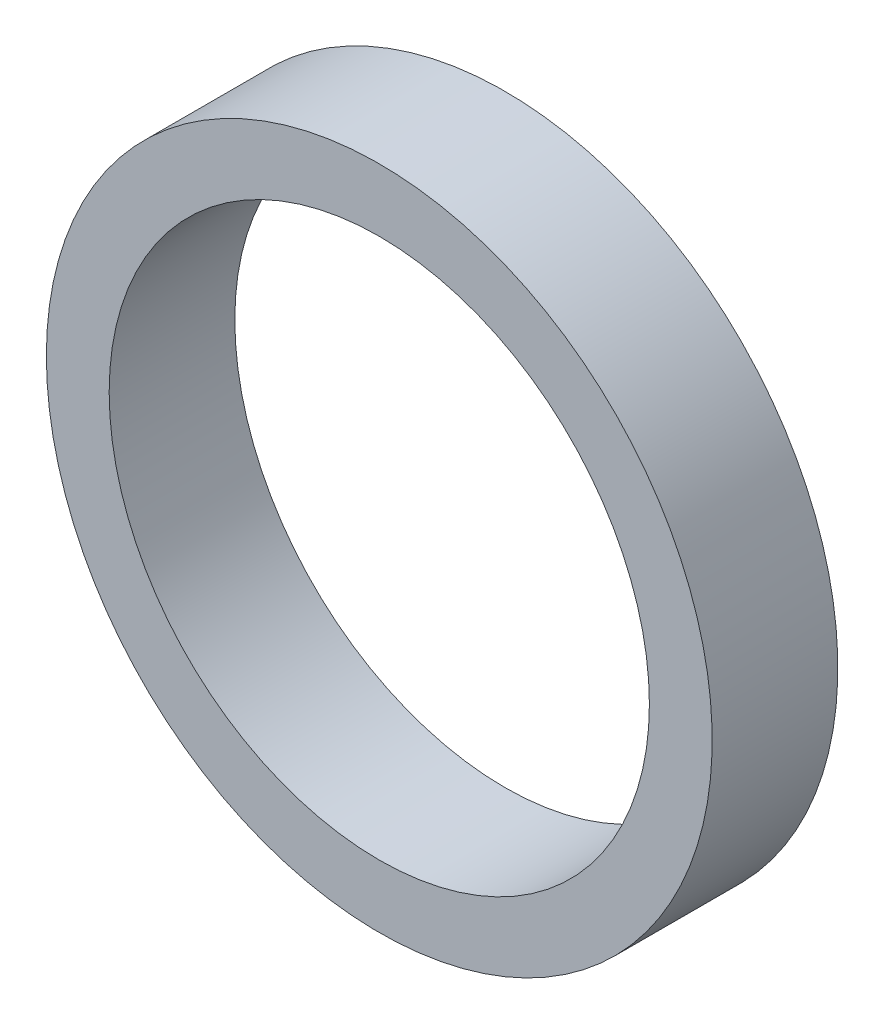
ISO-10303-21;
HEADER;
FILE_DESCRIPTION(('STEP AP214'),'2;1');
FILE_NAME('part.step','',(''),(''),'','','');
FILE_SCHEMA(('AUTOMOTIVE_DESIGN { 1 0 10303 214 1 1 1 1 }'));
ENDSEC;
DATA;
#1=APPLICATION_CONTEXT('core data for automotive mechanical design processes');
#2=APPLICATION_PROTOCOL_DEFINITION('international standard','automotive_design',2000,#1);
#3=PRODUCT_CONTEXT('',#1,'mechanical');
#4=PRODUCT('Part','Part','',(#3));
#5=PRODUCT_RELATED_PRODUCT_CATEGORY('part','',(#4));
#6=PRODUCT_DEFINITION_FORMATION('','',#4);
#7=PRODUCT_DEFINITION_CONTEXT('part definition',#1,'design');
#8=PRODUCT_DEFINITION('design','',#6,#7);
#9=PRODUCT_DEFINITION_SHAPE('','',#8);
#10=(LENGTH_UNIT() NAMED_UNIT(*) SI_UNIT(.MILLI.,.METRE.));
#11=(NAMED_UNIT(*) PLANE_ANGLE_UNIT() SI_UNIT($,.RADIAN.));
#12=(NAMED_UNIT(*) SI_UNIT($,.STERADIAN.) SOLID_ANGLE_UNIT());
#13=UNCERTAINTY_MEASURE_WITH_UNIT(LENGTH_MEASURE(1.E-05),#10,'distance_accuracy_value','');
#14=(GEOMETRIC_REPRESENTATION_CONTEXT(3) GLOBAL_UNCERTAINTY_ASSIGNED_CONTEXT((#13)) GLOBAL_UNIT_ASSIGNED_CONTEXT((#10,
#11,#12)) REPRESENTATION_CONTEXT('',''));
#15=CARTESIAN_POINT('',(0.,0.,0.));
#16=DIRECTION('',(0.,0.,1.));
#17=DIRECTION('',(1.,0.,0.));
#18=AXIS2_PLACEMENT_3D('',#15,#16,#17);
#19=CARTESIAN_POINT('',(0.,0.,3.3274));
#20=DIRECTION('',(0.,0.,-1.));
#21=DIRECTION('',(-1.,0.,0.));
#22=AXIS2_PLACEMENT_3D('',#19,#20,#21);
#23=CYLINDRICAL_SURFACE('',#22,5.461);
#24=CARTESIAN_POINT('',(0.,0.,4.5974));
#25=DIRECTION('',(0.,0.,-1.));
#26=DIRECTION('',(-1.,0.,0.));
#27=AXIS2_PLACEMENT_3D('',#24,#25,#26);
#28=CIRCLE('',#27,5.461);
#29=CARTESIAN_POINT('',(-5.461,0.,4.5974));
#30=VERTEX_POINT('',#29);
#31=EDGE_CURVE('E26',#30,#30,#28,.T.);
#32=ORIENTED_EDGE('',*,*,#31,.F.);
#33=EDGE_LOOP('',(#32));
#34=FACE_BOUND('',#33,.T.);
#35=CARTESIAN_POINT('',(0.,0.,2.0574));
#36=DIRECTION('',(0.,0.,-1.));
#37=DIRECTION('',(-1.,0.,0.));
#38=AXIS2_PLACEMENT_3D('',#35,#36,#37);
#39=CIRCLE('',#38,5.461);
#40=CARTESIAN_POINT('',(-5.461,0.,2.0574));
#41=VERTEX_POINT('',#40);
#42=EDGE_CURVE('E17',#41,#41,#39,.F.);
#43=ORIENTED_EDGE('',*,*,#42,.F.);
#44=EDGE_LOOP('',(#43));
#45=FACE_BOUND('',#44,.T.);
#46=ADVANCED_FACE('F14',(#34,#45),#23,.F.);
#47=CARTESIAN_POINT('',(0.,5.461,2.0574));
#48=DIRECTION('',(0.,0.,-1.));
#49=DIRECTION('',(-1.,0.,0.));
#50=AXIS2_PLACEMENT_3D('',#47,#48,#49);
#51=PLANE('',#50);
#52=ORIENTED_EDGE('',*,*,#42,.T.);
#53=EDGE_LOOP('',(#52));
#54=FACE_BOUND('',#53,.T.);
#55=CARTESIAN_POINT('',(0.,0.,2.0574));
#56=DIRECTION('',(0.,0.,-1.));
#57=DIRECTION('',(-1.,0.,0.));
#58=AXIS2_PLACEMENT_3D('',#55,#56,#57);
#59=CIRCLE('',#58,6.731);
#60=CARTESIAN_POINT('',(-6.731,0.,2.0574));
#61=VERTEX_POINT('',#60);
#62=EDGE_CURVE('E21',#61,#61,#59,.F.);
#63=ORIENTED_EDGE('',*,*,#62,.F.);
#64=EDGE_LOOP('',(#63));
#65=FACE_BOUND('',#64,.T.);
#66=ADVANCED_FACE('F34',(#54,#65),#51,.T.);
#67=CARTESIAN_POINT('',(0.,6.731,4.5974));
#68=DIRECTION('',(0.,0.,1.));
#69=DIRECTION('',(1.,0.,0.));
#70=AXIS2_PLACEMENT_3D('',#67,#68,#69);
#71=PLANE('',#70);
#72=ORIENTED_EDGE('',*,*,#31,.T.);
#73=EDGE_LOOP('',(#72));
#74=FACE_BOUND('',#73,.T.);
#75=CARTESIAN_POINT('',(0.,0.,4.5974));
#76=DIRECTION('',(0.,0.,-1.));
#77=DIRECTION('',(-1.,0.,0.));
#78=AXIS2_PLACEMENT_3D('',#75,#76,#77);
#79=CIRCLE('',#78,6.731);
#80=CARTESIAN_POINT('',(-6.731,0.,4.5974));
#81=VERTEX_POINT('',#80);
#82=EDGE_CURVE('E10',#81,#81,#79,.T.);
#83=ORIENTED_EDGE('',*,*,#82,.F.);
#84=EDGE_LOOP('',(#83));
#85=FACE_BOUND('',#84,.T.);
#86=ADVANCED_FACE('F43',(#74,#85),#71,.T.);
#87=CARTESIAN_POINT('',(0.,0.,3.3274));
#88=DIRECTION('',(0.,0.,-1.));
#89=DIRECTION('',(-1.,0.,0.));
#90=AXIS2_PLACEMENT_3D('',#87,#88,#89);
#91=CYLINDRICAL_SURFACE('',#90,6.731);
#92=ORIENTED_EDGE('',*,*,#82,.T.);
#93=EDGE_LOOP('',(#92));
#94=FACE_BOUND('',#93,.T.);
#95=ORIENTED_EDGE('',*,*,#62,.T.);
#96=EDGE_LOOP('',(#95));
#97=FACE_BOUND('',#96,.T.);
#98=ADVANCED_FACE('F44',(#94,#97),#91,.T.);
#99=CLOSED_SHELL('',(#46,#66,#86,#98));
#100=MANIFOLD_SOLID_BREP('B1',#99);
#101=ADVANCED_BREP_SHAPE_REPRESENTATION('',(#18,#100),#14);
#102=SHAPE_DEFINITION_REPRESENTATION(#9,#101);
ENDSEC;
END-ISO-10303-21;
